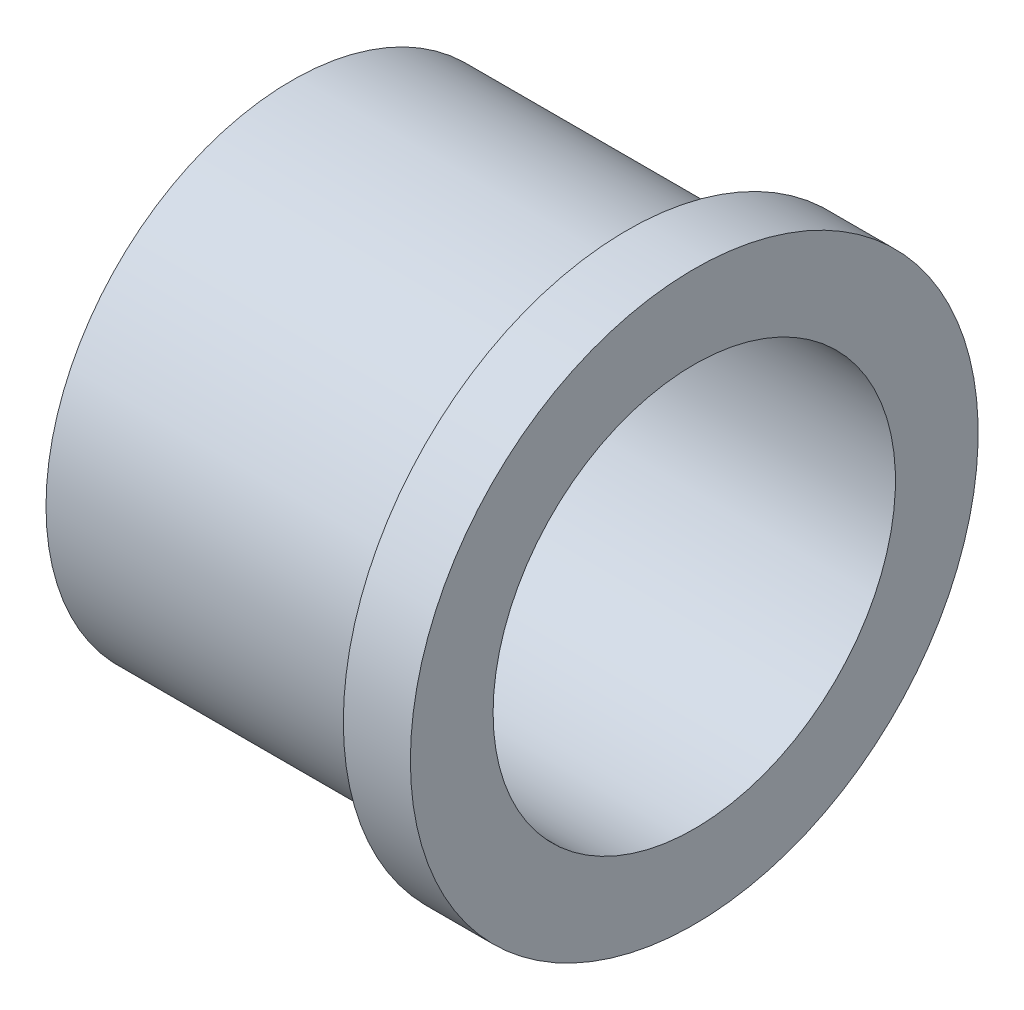
ISO-10303-21;
HEADER;
FILE_DESCRIPTION(('STEP AP214'),'2;1');
FILE_NAME('part.step','',(''),(''),'','','');
FILE_SCHEMA(('AUTOMOTIVE_DESIGN { 1 0 10303 214 1 1 1 1 }'));
ENDSEC;
DATA;
#1=APPLICATION_CONTEXT('core data for automotive mechanical design processes');
#2=APPLICATION_PROTOCOL_DEFINITION('international standard','automotive_design',2000,#1);
#3=PRODUCT_CONTEXT('',#1,'mechanical');
#4=PRODUCT('Part','Part','',(#3));
#5=PRODUCT_RELATED_PRODUCT_CATEGORY('part','',(#4));
#6=PRODUCT_DEFINITION_FORMATION('','',#4);
#7=PRODUCT_DEFINITION_CONTEXT('part definition',#1,'design');
#8=PRODUCT_DEFINITION('design','',#6,#7);
#9=PRODUCT_DEFINITION_SHAPE('','',#8);
#10=(LENGTH_UNIT() NAMED_UNIT(*) SI_UNIT(.MILLI.,.METRE.));
#11=(NAMED_UNIT(*) PLANE_ANGLE_UNIT() SI_UNIT($,.RADIAN.));
#12=(NAMED_UNIT(*) SI_UNIT($,.STERADIAN.) SOLID_ANGLE_UNIT());
#13=UNCERTAINTY_MEASURE_WITH_UNIT(LENGTH_MEASURE(1.E-05),#10,'distance_accuracy_value','');
#14=(GEOMETRIC_REPRESENTATION_CONTEXT(3) GLOBAL_UNCERTAINTY_ASSIGNED_CONTEXT((#13)) GLOBAL_UNIT_ASSIGNED_CONTEXT((#10,
#11,#12)) REPRESENTATION_CONTEXT('',''));
#15=CARTESIAN_POINT('',(0.,0.,0.));
#16=DIRECTION('',(0.,0.,1.));
#17=DIRECTION('',(1.,0.,0.));
#18=AXIS2_PLACEMENT_3D('',#15,#16,#17);
#19=CARTESIAN_POINT('',(-93.5890788796071,0.,0.));
#20=DIRECTION('',(-1.,0.,0.));
#21=DIRECTION('',(0.,0.,1.));
#22=AXIS2_PLACEMENT_3D('',#19,#20,#21);
#23=CYLINDRICAL_SURFACE('',#22,12.7);
#24=CARTESIAN_POINT('',(0.,0.,0.));
#25=DIRECTION('',(-1.,0.,0.));
#26=DIRECTION('',(0.,0.,1.));
#27=AXIS2_PLACEMENT_3D('',#24,#25,#26);
#28=CIRCLE('',#27,12.7);
#29=CARTESIAN_POINT('',(0.,0.,12.7));
#30=VERTEX_POINT('',#29);
#31=EDGE_CURVE('E10',#30,#30,#28,.T.);
#32=ORIENTED_EDGE('',*,*,#31,.F.);
#33=EDGE_LOOP('',(#32));
#34=FACE_BOUND('',#33,.T.);
#35=CARTESIAN_POINT('',(3.,0.,0.));
#36=DIRECTION('',(-1.,0.,0.));
#37=DIRECTION('',(0.,0.,1.));
#38=AXIS2_PLACEMENT_3D('',#35,#36,#37);
#39=CIRCLE('',#38,12.7);
#40=CARTESIAN_POINT('',(3.,0.,12.7));
#41=VERTEX_POINT('',#40);
#42=EDGE_CURVE('E52',#41,#41,#39,.T.);
#43=ORIENTED_EDGE('',*,*,#42,.T.);
#44=EDGE_LOOP('',(#43));
#45=FACE_BOUND('',#44,.T.);
#46=ADVANCED_FACE('F30',(#34,#45),#23,.T.);
#47=CARTESIAN_POINT('',(0.,0.,-12.7));
#48=DIRECTION('',(1.,0.,0.));
#49=DIRECTION('',(0.,0.,-1.));
#50=AXIS2_PLACEMENT_3D('',#47,#48,#49);
#51=PLANE('',#50);
#52=CARTESIAN_POINT('',(0.,0.,0.));
#53=DIRECTION('',(-1.,0.,0.));
#54=DIRECTION('',(0.,0.,1.));
#55=AXIS2_PLACEMENT_3D('',#52,#53,#54);
#56=CIRCLE('',#55,11.);
#57=CARTESIAN_POINT('',(0.,0.,11.));
#58=VERTEX_POINT('',#57);
#59=EDGE_CURVE('E36',#58,#58,#56,.T.);
#60=ORIENTED_EDGE('',*,*,#59,.F.);
#61=EDGE_LOOP('',(#60));
#62=FACE_BOUND('',#61,.T.);
#63=ORIENTED_EDGE('',*,*,#31,.T.);
#64=EDGE_LOOP('',(#63));
#65=FACE_BOUND('',#64,.T.);
#66=ADVANCED_FACE('F77',(#62,#65),#51,.F.);
#67=CARTESIAN_POINT('',(-93.5890788796071,0.,0.));
#68=DIRECTION('',(-1.,0.,0.));
#69=DIRECTION('',(0.,0.,1.));
#70=AXIS2_PLACEMENT_3D('',#67,#68,#69);
#71=CYLINDRICAL_SURFACE('',#70,11.);
#72=CARTESIAN_POINT('',(-15.,0.,0.));
#73=DIRECTION('',(-1.,0.,0.));
#74=DIRECTION('',(0.,0.,1.));
#75=AXIS2_PLACEMENT_3D('',#72,#73,#74);
#76=CIRCLE('',#75,11.);
#77=CARTESIAN_POINT('',(-15.,0.,11.));
#78=VERTEX_POINT('',#77);
#79=EDGE_CURVE('E40',#78,#78,#76,.T.);
#80=ORIENTED_EDGE('',*,*,#79,.F.);
#81=EDGE_LOOP('',(#80));
#82=FACE_BOUND('',#81,.T.);
#83=ORIENTED_EDGE('',*,*,#59,.T.);
#84=EDGE_LOOP('',(#83));
#85=FACE_BOUND('',#84,.T.);
#86=ADVANCED_FACE('F72',(#82,#85),#71,.T.);
#87=CARTESIAN_POINT('',(-15.,0.,-11.));
#88=DIRECTION('',(1.,0.,0.));
#89=DIRECTION('',(0.,0.,-1.));
#90=AXIS2_PLACEMENT_3D('',#87,#88,#89);
#91=PLANE('',#90);
#92=CARTESIAN_POINT('',(-15.,0.,0.));
#93=DIRECTION('',(-1.,0.,0.));
#94=DIRECTION('',(0.,0.,1.));
#95=AXIS2_PLACEMENT_3D('',#92,#93,#94);
#96=CIRCLE('',#95,9.);
#97=CARTESIAN_POINT('',(-15.,0.,9.));
#98=VERTEX_POINT('',#97);
#99=EDGE_CURVE('E44',#98,#98,#96,.T.);
#100=ORIENTED_EDGE('',*,*,#99,.F.);
#101=EDGE_LOOP('',(#100));
#102=FACE_BOUND('',#101,.T.);
#103=ORIENTED_EDGE('',*,*,#79,.T.);
#104=EDGE_LOOP('',(#103));
#105=FACE_BOUND('',#104,.T.);
#106=ADVANCED_FACE('F66',(#102,#105),#91,.F.);
#107=CARTESIAN_POINT('',(-93.5890788796071,0.,0.));
#108=DIRECTION('',(-1.,0.,0.));
#109=DIRECTION('',(0.,0.,1.));
#110=AXIS2_PLACEMENT_3D('',#107,#108,#109);
#111=CYLINDRICAL_SURFACE('',#110,9.);
#112=CARTESIAN_POINT('',(3.,0.,0.));
#113=DIRECTION('',(-1.,0.,0.));
#114=DIRECTION('',(0.,0.,1.));
#115=AXIS2_PLACEMENT_3D('',#112,#113,#114);
#116=CIRCLE('',#115,9.);
#117=CARTESIAN_POINT('',(3.,0.,9.));
#118=VERTEX_POINT('',#117);
#119=EDGE_CURVE('E49',#118,#118,#116,.T.);
#120=ORIENTED_EDGE('',*,*,#119,.F.);
#121=EDGE_LOOP('',(#120));
#122=FACE_BOUND('',#121,.T.);
#123=ORIENTED_EDGE('',*,*,#99,.T.);
#124=EDGE_LOOP('',(#123));
#125=FACE_BOUND('',#124,.T.);
#126=ADVANCED_FACE('F60',(#122,#125),#111,.F.);
#127=CARTESIAN_POINT('',(3.,0.,-9.));
#128=DIRECTION('',(-1.,0.,0.));
#129=DIRECTION('',(0.,0.,1.));
#130=AXIS2_PLACEMENT_3D('',#127,#128,#129);
#131=PLANE('',#130);
#132=ORIENTED_EDGE('',*,*,#42,.F.);
#133=EDGE_LOOP('',(#132));
#134=FACE_BOUND('',#133,.T.);
#135=ORIENTED_EDGE('',*,*,#119,.T.);
#136=EDGE_LOOP('',(#135));
#137=FACE_BOUND('',#136,.T.);
#138=ADVANCED_FACE('F57',(#134,#137),#131,.F.);
#139=CLOSED_SHELL('',(#46,#66,#86,#106,#126,#138));
#140=MANIFOLD_SOLID_BREP('B2',#139);
#141=ADVANCED_BREP_SHAPE_REPRESENTATION('',(#18,#140),#14);
#142=SHAPE_DEFINITION_REPRESENTATION(#9,#141);
ENDSEC;
END-ISO-10303-21;
